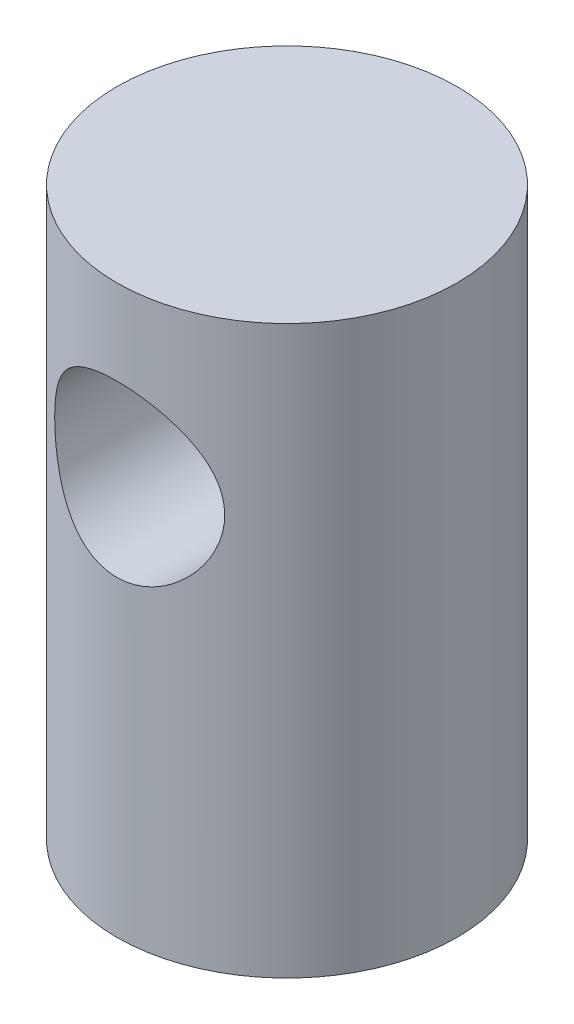
ISO-10303-21;
HEADER;
FILE_DESCRIPTION(('STEP AP214'),'2;1');
FILE_NAME('part.step','',(''),(''),'','','');
FILE_SCHEMA(('AUTOMOTIVE_DESIGN { 1 0 10303 214 1 1 1 1 }'));
ENDSEC;
DATA;
#1=APPLICATION_CONTEXT('core data for automotive mechanical design processes');
#2=APPLICATION_PROTOCOL_DEFINITION('international standard','automotive_design',2000,#1);
#3=PRODUCT_CONTEXT('',#1,'mechanical');
#4=PRODUCT('Part','Part','',(#3));
#5=PRODUCT_RELATED_PRODUCT_CATEGORY('part','',(#4));
#6=PRODUCT_DEFINITION_FORMATION('','',#4);
#7=PRODUCT_DEFINITION_CONTEXT('part definition',#1,'design');
#8=PRODUCT_DEFINITION('design','',#6,#7);
#9=PRODUCT_DEFINITION_SHAPE('','',#8);
#10=(LENGTH_UNIT() NAMED_UNIT(*) SI_UNIT(.MILLI.,.METRE.));
#11=(NAMED_UNIT(*) PLANE_ANGLE_UNIT() SI_UNIT($,.RADIAN.));
#12=(NAMED_UNIT(*) SI_UNIT($,.STERADIAN.) SOLID_ANGLE_UNIT());
#13=UNCERTAINTY_MEASURE_WITH_UNIT(LENGTH_MEASURE(1.E-05),#10,'distance_accuracy_value','');
#14=(GEOMETRIC_REPRESENTATION_CONTEXT(3) GLOBAL_UNCERTAINTY_ASSIGNED_CONTEXT((#13)) GLOBAL_UNIT_ASSIGNED_CONTEXT((#10,
#11,#12)) REPRESENTATION_CONTEXT('',''));
#15=CARTESIAN_POINT('',(0.,0.,0.));
#16=DIRECTION('',(0.,0.,1.));
#17=DIRECTION('',(1.,0.,0.));
#18=AXIS2_PLACEMENT_3D('',#15,#16,#17);
#19=CARTESIAN_POINT('',(0.,12.7,0.));
#20=DIRECTION('',(0.,-1.,0.));
#21=DIRECTION('',(0.,0.,-1.));
#22=AXIS2_PLACEMENT_3D('',#19,#20,#21);
#23=CYLINDRICAL_SURFACE('',#22,3.81);
#24=CARTESIAN_POINT('',(0.,12.7,0.));
#25=DIRECTION('',(0.,1.,0.));
#26=DIRECTION('',(0.,0.,1.));
#27=AXIS2_PLACEMENT_3D('',#24,#25,#26);
#28=CIRCLE('',#27,3.81);
#29=CARTESIAN_POINT('',(0.,12.7,3.81));
#30=VERTEX_POINT('',#29);
#31=EDGE_CURVE('E10',#30,#30,#28,.T.);
#32=ORIENTED_EDGE('',*,*,#31,.F.);
#33=EDGE_LOOP('',(#32));
#34=FACE_BOUND('',#33,.T.);
#35=CARTESIAN_POINT('',(0.,0.,0.));
#36=DIRECTION('',(0.,1.,0.));
#37=DIRECTION('',(0.,0.,1.));
#38=AXIS2_PLACEMENT_3D('',#35,#36,#37);
#39=CIRCLE('',#38,3.81);
#40=CARTESIAN_POINT('',(0.,0.,3.81));
#41=VERTEX_POINT('',#40);
#42=EDGE_CURVE('E47',#41,#41,#39,.T.);
#43=ORIENTED_EDGE('',*,*,#42,.T.);
#44=EDGE_LOOP('',(#43));
#45=FACE_BOUND('',#44,.T.);
#46=CARTESIAN_POINT('',(-1.905,8.89,3.29955678841871));
#47=CARTESIAN_POINT('',(-1.90499198708214,8.79073692178569,3.29956654394383));
#48=CARTESIAN_POINT('',(-1.89718915338941,8.69134452685156,3.30410470951591));
#49=CARTESIAN_POINT('',(-1.866373006325,8.49561244368785,3.32160278339791));
#50=CARTESIAN_POINT('',(-1.84332773093618,8.39927961690651,3.33458038748244));
#51=CARTESIAN_POINT('',(-1.78327032472124,8.21286474348429,3.36707513169226));
#52=CARTESIAN_POINT('',(-1.74633243851905,8.12275243094609,3.38655744838383));
#53=CARTESIAN_POINT('',(-1.65976465650994,7.95002685092146,3.42981274244804));
#54=CARTESIAN_POINT('',(-1.61013407408157,7.86741398945147,3.45358595191944));
#55=CARTESIAN_POINT('',(-1.49478975349745,7.70450760041545,3.50514036225373));
#56=CARTESIAN_POINT('',(-1.4280871271849,7.62496735011884,3.53309041410511));
#57=CARTESIAN_POINT('',(-1.28254850517537,7.4776170165065,3.58848627026471));
#58=CARTESIAN_POINT('',(-1.20370649407611,7.40981278429071,3.61593181698771));
#59=CARTESIAN_POINT('',(-1.0296326178128,7.28338557811796,3.66943913648482));
#60=CARTESIAN_POINT('',(-0.933654194937513,7.2256895725093,3.69528292740811));
#61=CARTESIAN_POINT('',(-0.731819135803414,7.1276066742853,3.74048190355419));
#62=CARTESIAN_POINT('',(-0.625968785187166,7.08720885798586,3.75984118201359));
#63=CARTESIAN_POINT('',(-0.415375618147424,7.02785362028905,3.7886727867368));
#64=CARTESIAN_POINT('',(-0.311089910872768,7.00757515231077,3.79875059821709));
#65=CARTESIAN_POINT('',(-0.100147047677825,6.984683543906,3.81014447225848));
#66=CARTESIAN_POINT('',(0.00650863413015958,6.98205971479954,3.8114658362441));
#67=CARTESIAN_POINT('',(0.209230959029217,6.99404241391774,3.80548480551051));
#68=CARTESIAN_POINT('',(0.305411884432316,7.00717041956906,3.79892234674623));
#69=CARTESIAN_POINT('',(0.493992735503874,7.04763800763724,3.77902937219762));
#70=CARTESIAN_POINT('',(0.586392377683784,7.0749786534994,3.76569834996465));
#71=CARTESIAN_POINT('',(0.766399390940143,7.1432722884014,3.73325866162997));
#72=CARTESIAN_POINT('',(0.853922771796453,7.18440837659287,3.71407261113128));
#73=CARTESIAN_POINT('',(1.02103580688285,7.27887180786376,3.67165215604635));
#74=CARTESIAN_POINT('',(1.10062260603761,7.33220351559095,3.64841630280006));
#75=CARTESIAN_POINT('',(1.25763082401107,7.45533564467042,3.59748571330533));
#76=CARTESIAN_POINT('',(1.33413641293093,7.52621626896105,3.56957711276524));
#77=CARTESIAN_POINT('',(1.47466882541727,7.67954342599198,3.51385518817876));
#78=CARTESIAN_POINT('',(1.53868604804891,7.76199877418208,3.48604195346023));
#79=CARTESIAN_POINT('',(1.65640766249341,7.94254480656788,3.43174617356183));
#80=CARTESIAN_POINT('',(1.70919898503319,8.04129587391827,3.40546029582298));
#81=CARTESIAN_POINT('',(1.79702291026734,8.24789626393889,3.35995232780687));
#82=CARTESIAN_POINT('',(1.83207404389174,8.35573595489845,3.34072287237758));
#83=CARTESIAN_POINT('',(1.8805783020027,8.56846364399371,3.3136453123145));
#84=CARTESIAN_POINT('',(1.89552285763855,8.67290833177796,3.30501604391386));
#85=CARTESIAN_POINT('',(1.90788978329477,8.88314455558901,3.29789636383866));
#86=CARTESIAN_POINT('',(1.90532453068513,8.98893508747321,3.29939879024139));
#87=CARTESIAN_POINT('',(1.88411366257025,9.18652071489246,3.31154411109814));
#88=CARTESIAN_POINT('',(1.86725779083724,9.27858085436053,3.32116914200176));
#89=CARTESIAN_POINT('',(1.82060142222481,9.45839063284624,3.34697111055305));
#90=CARTESIAN_POINT('',(1.79079673327802,9.54613886567254,3.3631501698959));
#91=CARTESIAN_POINT('',(1.71763865629227,9.71945858536937,3.40111503061746));
#92=CARTESIAN_POINT('',(1.6737216913345,9.80474102710501,3.42312580378035));
#93=CARTESIAN_POINT('',(1.57407685695025,9.96721896228279,3.47007407642261));
#94=CARTESIAN_POINT('',(1.5183429202534,10.0444102708966,3.49501307641559));
#95=CARTESIAN_POINT('',(1.38843480351322,10.1986945521281,3.54878637059317));
#96=CARTESIAN_POINT('',(1.31282174375767,10.2745485721004,3.57771540908909));
#97=CARTESIAN_POINT('',(1.14948556373608,10.4128803133945,3.63348717632896));
#98=CARTESIAN_POINT('',(1.06175836922721,10.4753535163518,3.66032919839729));
#99=CARTESIAN_POINT('',(0.873509865665426,10.5865429478707,3.70982294021229));
#100=CARTESIAN_POINT('',(0.772712000844651,10.6348525899488,3.73234537385049));
#101=CARTESIAN_POINT('',(0.562970104675267,10.7133477070911,3.76967791197634));
#102=CARTESIAN_POINT('',(0.454033321279064,10.7435490967591,3.78449478704111));
#103=CARTESIAN_POINT('',(0.241896294724125,10.7823671139296,3.80366603085923));
#104=CARTESIAN_POINT('',(0.139086800123056,10.7927099506027,3.80885562663092));
#105=CARTESIAN_POINT('',(-0.0669150028251223,10.7966064236309,3.81080258366636));
#106=CARTESIAN_POINT('',(-0.170107164529987,10.7901659372737,3.80756289674906));
#107=CARTESIAN_POINT('',(-0.366784876795357,10.7618217348386,3.79350210629254));
#108=CARTESIAN_POINT('',(-0.460461970607189,10.7409649252131,3.78319464317244));
#109=CARTESIAN_POINT('',(-0.642834533732313,10.6857921032841,3.75650938454101));
#110=CARTESIAN_POINT('',(-0.731529286560456,10.6514741608392,3.74013071852114));
#111=CARTESIAN_POINT('',(-0.905681609000894,10.5688248221207,3.70190897977004));
#112=CARTESIAN_POINT('',(-0.99083847335106,10.5199568431864,3.67986215390147));
#113=CARTESIAN_POINT('',(-1.15209561611304,10.4102706880675,3.63260894008916));
#114=CARTESIAN_POINT('',(-1.22819170900713,10.3494470232183,3.60740110290715));
#115=CARTESIAN_POINT('',(-1.37715149251169,10.2105492046297,3.55337000945654));
#116=CARTESIAN_POINT('',(-1.44893981749937,10.1313606927877,3.52443661119087));
#117=CARTESIAN_POINT('',(-1.5786023329529,9.96166515253845,3.46830166093714));
#118=CARTESIAN_POINT('',(-1.63646421361484,9.87114821737911,3.44110165662072));
#119=CARTESIAN_POINT('',(-1.73818595767762,9.67742327834094,3.39089224909556));
#120=CARTESIAN_POINT('',(-1.78154554518773,9.57390461002466,3.3680424409578));
#121=CARTESIAN_POINT('',(-1.83257122853322,9.41332434105153,3.34038147771082));
#122=CARTESIAN_POINT('',(-1.84723722005939,9.35896545088738,3.33226780836254));
#123=CARTESIAN_POINT('',(-1.87173936489303,9.24887098898107,3.31856771505668));
#124=CARTESIAN_POINT('',(-1.88157889504476,9.19313640850158,3.31297952435838));
#125=CARTESIAN_POINT('',(-1.89426468645562,9.09612024824196,3.30573720044492));
#126=CARTESIAN_POINT('',(-1.89828575114556,9.05503676296931,3.30342611219554));
#127=CARTESIAN_POINT('',(-1.90365516558915,8.97264300232902,3.30033382393031));
#128=CARTESIAN_POINT('',(-1.90500333654398,8.93133271197497,3.29955272626069));
#129=CARTESIAN_POINT('',(-1.905,8.89,3.29955678841871));
#130=B_SPLINE_CURVE_WITH_KNOTS('',3,(#46,#47,#48,#49,#50,#51,#52,#53,#54,#55,#56,#57,#58,#59,
#60,#61,#62,#63,#64,#65,#66,#67,#68,#69,#70,#71,#72,#73,#74,#75,#76,#77,#78,#79,#80,#81,#82,#83,
#84,#85,#86,#87,#88,#89,#90,#91,#92,#93,#94,#95,#96,#97,#98,#99,#100,#101,#102,#103,#104,#105,
#106,#107,#108,#109,#110,#111,#112,#113,#114,#115,#116,#117,#118,#119,#120,#121,#122,#123,#124,
#125,#126,#127,#128,#129),.UNSPECIFIED.,.T.,.F.,(4,2,2,2,2,2,2,2,2,2,2,2,2,2,2,2,2,2,2,2,2,2,2,
2,2,2,2,2,2,2,2,2,2,2,2,2,2,2,2,2,2,4),(0.,0.297622193542932,0.595870460831253,
0.892546975248113,1.18923954201175,1.51040270534787,1.831725529196,2.17470784718718,
2.51747325370086,2.8358493886779,3.1540327512578,3.44454665711919,3.73508230349625,
4.02963763666708,4.32429855266141,4.6468129972925,4.96957441912348,5.31283243498472,
5.65573114877171,5.97145664081147,6.28695897527724,6.56794819426642,6.84902844894574,
7.1431269965747,7.43737691253064,7.76871846524942,8.10017172787349,8.44037265595573,
8.78027415539583,9.08898875095846,9.39759525346389,9.68586629384066,9.97417868344258,
10.2748223012447,10.5756042634574,10.9063201072825,11.2373272112389,11.5787947692241,
11.7492204045702,11.9195266305643,12.0434469221419,12.1673755028827),.UNSPECIFIED.);
#131=CARTESIAN_POINT('',(-1.905,8.89,3.29955678841871));
#132=VERTEX_POINT('',#131);
#133=EDGE_CURVE('E39',#132,#132,#130,.T.);
#134=ORIENTED_EDGE('',*,*,#133,.F.);
#135=EDGE_LOOP('',(#134));
#136=FACE_BOUND('',#135,.T.);
#137=CARTESIAN_POINT('',(1.905,8.89,-3.29955678841871));
#138=CARTESIAN_POINT('',(1.90499198708214,8.79073692178569,-3.29956654394383));
#139=CARTESIAN_POINT('',(1.89718915338941,8.69134452685156,-3.30410470951591));
#140=CARTESIAN_POINT('',(1.866373006325,8.49561244368785,-3.32160278339791));
#141=CARTESIAN_POINT('',(1.84332773093618,8.39927961690651,-3.33458038748244));
#142=CARTESIAN_POINT('',(1.78327032472124,8.21286474348429,-3.36707513169226));
#143=CARTESIAN_POINT('',(1.74633243851905,8.12275243094609,-3.38655744838383));
#144=CARTESIAN_POINT('',(1.65976465650994,7.95002685092146,-3.42981274244804));
#145=CARTESIAN_POINT('',(1.61013407408157,7.86741398945147,-3.45358595191944));
#146=CARTESIAN_POINT('',(1.49478975349745,7.70450760041545,-3.50514036225373));
#147=CARTESIAN_POINT('',(1.4280871271849,7.62496735011884,-3.53309041410511));
#148=CARTESIAN_POINT('',(1.28254850517537,7.4776170165065,-3.58848627026471));
#149=CARTESIAN_POINT('',(1.20370649407611,7.40981278429072,-3.61593181698771));
#150=CARTESIAN_POINT('',(1.0296326178128,7.28338557811796,-3.66943913648482));
#151=CARTESIAN_POINT('',(0.933654194937514,7.2256895725093,-3.69528292740811));
#152=CARTESIAN_POINT('',(0.731819135803414,7.1276066742853,-3.74048190355419));
#153=CARTESIAN_POINT('',(0.625968785187166,7.08720885798586,-3.75984118201359));
#154=CARTESIAN_POINT('',(0.415375618147424,7.02785362028905,-3.7886727867368));
#155=CARTESIAN_POINT('',(0.311089910872768,7.00757515231077,-3.79875059821709));
#156=CARTESIAN_POINT('',(0.100147047677825,6.984683543906,-3.81014447225848));
#157=CARTESIAN_POINT('',(-0.00650863413015957,6.98205971479954,-3.8114658362441));
#158=CARTESIAN_POINT('',(-0.209230959029217,6.99404241391775,-3.80548480551051));
#159=CARTESIAN_POINT('',(-0.305411884432316,7.00717041956906,-3.79892234674623));
#160=CARTESIAN_POINT('',(-0.493992735503874,7.04763800763724,-3.77902937219762));
#161=CARTESIAN_POINT('',(-0.586392377683785,7.0749786534994,-3.76569834996465));
#162=CARTESIAN_POINT('',(-0.766399390940144,7.1432722884014,-3.73325866162997));
#163=CARTESIAN_POINT('',(-0.853922771796453,7.18440837659287,-3.71407261113128));
#164=CARTESIAN_POINT('',(-1.02103580688285,7.27887180786376,-3.67165215604635));
#165=CARTESIAN_POINT('',(-1.10062260603761,7.33220351559095,-3.64841630280006));
#166=CARTESIAN_POINT('',(-1.25763082401107,7.45533564467042,-3.59748571330533));
#167=CARTESIAN_POINT('',(-1.33413641293093,7.52621626896105,-3.56957711276524));
#168=CARTESIAN_POINT('',(-1.47466882541727,7.67954342599198,-3.51385518817876));
#169=CARTESIAN_POINT('',(-1.53868604804891,7.76199877418209,-3.48604195346023));
#170=CARTESIAN_POINT('',(-1.65640766249341,7.94254480656789,-3.43174617356183));
#171=CARTESIAN_POINT('',(-1.70919898503319,8.04129587391827,-3.40546029582298));
#172=CARTESIAN_POINT('',(-1.79702291026734,8.24789626393889,-3.35995232780687));
#173=CARTESIAN_POINT('',(-1.83207404389174,8.35573595489845,-3.34072287237758));
#174=CARTESIAN_POINT('',(-1.8805783020027,8.56846364399371,-3.3136453123145));
#175=CARTESIAN_POINT('',(-1.89552285763855,8.67290833177796,-3.30501604391386));
#176=CARTESIAN_POINT('',(-1.90788978329477,8.88314455558902,-3.29789636383866));
#177=CARTESIAN_POINT('',(-1.90532453068513,8.98893508747321,-3.29939879024139));
#178=CARTESIAN_POINT('',(-1.88411366257025,9.18652071489246,-3.31154411109814));
#179=CARTESIAN_POINT('',(-1.86725779083724,9.27858085436053,-3.32116914200176));
#180=CARTESIAN_POINT('',(-1.82060142222481,9.45839063284624,-3.34697111055305));
#181=CARTESIAN_POINT('',(-1.79079673327802,9.54613886567254,-3.3631501698959));
#182=CARTESIAN_POINT('',(-1.71763865629227,9.71945858536937,-3.40111503061746));
#183=CARTESIAN_POINT('',(-1.6737216913345,9.80474102710501,-3.42312580378035));
#184=CARTESIAN_POINT('',(-1.57407685695025,9.96721896228279,-3.47007407642261));
#185=CARTESIAN_POINT('',(-1.5183429202534,10.0444102708966,-3.49501307641559));
#186=CARTESIAN_POINT('',(-1.38843480351322,10.1986945521281,-3.54878637059317));
#187=CARTESIAN_POINT('',(-1.31282174375767,10.2745485721004,-3.57771540908909));
#188=CARTESIAN_POINT('',(-1.14948556373608,10.4128803133945,-3.63348717632896));
#189=CARTESIAN_POINT('',(-1.06175836922721,10.4753535163518,-3.66032919839729));
#190=CARTESIAN_POINT('',(-0.873509865665426,10.5865429478707,-3.70982294021229));
#191=CARTESIAN_POINT('',(-0.772712000844651,10.6348525899488,-3.73234537385049));
#192=CARTESIAN_POINT('',(-0.562970104675267,10.7133477070911,-3.76967791197634));
#193=CARTESIAN_POINT('',(-0.454033321279064,10.7435490967591,-3.78449478704111));
#194=CARTESIAN_POINT('',(-0.241896294724125,10.7823671139296,-3.80366603085923));
#195=CARTESIAN_POINT('',(-0.139086800123056,10.7927099506027,-3.80885562663092));
#196=CARTESIAN_POINT('',(0.0669150028251231,10.7966064236309,-3.81080258366636));
#197=CARTESIAN_POINT('',(0.170107164529987,10.7901659372737,-3.80756289674906));
#198=CARTESIAN_POINT('',(0.366784876795358,10.7618217348386,-3.79350210629254));
#199=CARTESIAN_POINT('',(0.460461970607191,10.7409649252131,-3.78319464317244));
#200=CARTESIAN_POINT('',(0.642834533732315,10.6857921032841,-3.75650938454101));
#201=CARTESIAN_POINT('',(0.731529286560458,10.6514741608392,-3.74013071852114));
#202=CARTESIAN_POINT('',(0.905681609000896,10.5688248221207,-3.70190897977004));
#203=CARTESIAN_POINT('',(0.990838473351061,10.5199568431864,-3.67986215390147));
#204=CARTESIAN_POINT('',(1.15209561611304,10.4102706880675,-3.63260894008916));
#205=CARTESIAN_POINT('',(1.22819170900713,10.3494470232183,-3.60740110290715));
#206=CARTESIAN_POINT('',(1.37715149251169,10.2105492046297,-3.55337000945654));
#207=CARTESIAN_POINT('',(1.44893981749937,10.1313606927877,-3.52443661119087));
#208=CARTESIAN_POINT('',(1.57860233295291,9.96166515253845,-3.46830166093714));
#209=CARTESIAN_POINT('',(1.63646421361485,9.87114821737911,-3.44110165662072));
#210=CARTESIAN_POINT('',(1.73818595767762,9.67742327834094,-3.39089224909555));
#211=CARTESIAN_POINT('',(1.78154554518773,9.57390461002466,-3.3680424409578));
#212=CARTESIAN_POINT('',(1.83257122853322,9.41332434105153,-3.34038147771082));
#213=CARTESIAN_POINT('',(1.84723722005939,9.35896545088738,-3.33226780836254));
#214=CARTESIAN_POINT('',(1.87173936489303,9.24887098898107,-3.31856771505667));
#215=CARTESIAN_POINT('',(1.88157889504476,9.19313640850157,-3.31297952435838));
#216=CARTESIAN_POINT('',(1.89426468645562,9.09612024824196,-3.30573720044492));
#217=CARTESIAN_POINT('',(1.89828575114556,9.0550367629693,-3.30342611219554));
#218=CARTESIAN_POINT('',(1.90365516558915,8.97264300232902,-3.30033382393031));
#219=CARTESIAN_POINT('',(1.90500333654398,8.93133271197497,-3.29955272626068));
#220=CARTESIAN_POINT('',(1.905,8.89,-3.29955678841871));
#221=B_SPLINE_CURVE_WITH_KNOTS('',3,(#137,#138,#139,#140,#141,#142,#143,#144,#145,#146,#147,
#148,#149,#150,#151,#152,#153,#154,#155,#156,#157,#158,#159,#160,#161,#162,#163,#164,#165,#166,
#167,#168,#169,#170,#171,#172,#173,#174,#175,#176,#177,#178,#179,#180,#181,#182,#183,#184,#185,
#186,#187,#188,#189,#190,#191,#192,#193,#194,#195,#196,#197,#198,#199,#200,#201,#202,#203,#204,
#205,#206,#207,#208,#209,#210,#211,#212,#213,#214,#215,#216,#217,#218,#219,#220),.UNSPECIFIED.,
.T.,.F.,(4,2,2,2,2,2,2,2,2,2,2,2,2,2,2,2,2,2,2,2,2,2,2,2,2,2,2,2,2,2,2,2,2,2,2,2,2,2,2,2,2,4),
(0.,0.297622193542933,0.595870460831253,0.892546975248113,1.18923954201174,1.51040270534787,
1.831725529196,2.17470784718718,2.51747325370086,2.8358493886779,3.1540327512578,
3.44454665711919,3.73508230349625,4.02963763666708,4.32429855266141,4.6468129972925,
4.96957441912348,5.31283243498472,5.65573114877171,5.97145664081147,6.28695897527724,
6.56794819426642,6.84902844894574,7.14312699657471,7.43737691253064,7.76871846524942,
8.10017172787349,8.44037265595573,8.78027415539584,9.08898875095846,9.3975952534639,
9.68586629384067,9.97417868344258,10.2748223012447,10.5756042634574,10.9063201072825,
11.2373272112389,11.5787947692242,11.7492204045702,11.9195266305643,12.0434469221419,
12.1673755028828),.UNSPECIFIED.);
#222=CARTESIAN_POINT('',(1.905,8.89,-3.29955678841871));
#223=VERTEX_POINT('',#222);
#224=EDGE_CURVE('E53',#223,#223,#221,.T.);
#225=ORIENTED_EDGE('',*,*,#224,.F.);
#226=EDGE_LOOP('',(#225));
#227=FACE_BOUND('',#226,.T.);
#228=ADVANCED_FACE('F35',(#34,#45,#136,#227),#23,.T.);
#229=CARTESIAN_POINT('',(0.,12.7,0.));
#230=DIRECTION('',(0.,1.,0.));
#231=DIRECTION('',(0.,0.,1.));
#232=AXIS2_PLACEMENT_3D('',#229,#230,#231);
#233=PLANE('',#232);
#234=ORIENTED_EDGE('',*,*,#31,.T.);
#235=EDGE_LOOP('',(#234));
#236=FACE_BOUND('',#235,.T.);
#237=ADVANCED_FACE('F68',(#236),#233,.T.);
#238=CARTESIAN_POINT('',(0.,0.,0.));
#239=DIRECTION('',(0.,1.,0.));
#240=DIRECTION('',(0.,0.,1.));
#241=AXIS2_PLACEMENT_3D('',#238,#239,#240);
#242=PLANE('',#241);
#243=ORIENTED_EDGE('',*,*,#42,.F.);
#244=EDGE_LOOP('',(#243));
#245=FACE_BOUND('',#244,.T.);
#246=ADVANCED_FACE('F66',(#245),#242,.F.);
#247=CARTESIAN_POINT('',(0.,8.89,19.05));
#248=DIRECTION('',(0.,0.,-1.));
#249=DIRECTION('',(-1.,0.,0.));
#250=AXIS2_PLACEMENT_3D('',#247,#248,#249);
#251=CYLINDRICAL_SURFACE('',#250,1.905);
#252=ORIENTED_EDGE('',*,*,#224,.T.);
#253=EDGE_LOOP('',(#252));
#254=FACE_BOUND('',#253,.T.);
#255=ORIENTED_EDGE('',*,*,#133,.T.);
#256=EDGE_LOOP('',(#255));
#257=FACE_BOUND('',#256,.T.);
#258=ADVANCED_FACE('F62',(#254,#257),#251,.F.);
#259=CLOSED_SHELL('',(#228,#237,#246,#258));
#260=MANIFOLD_SOLID_BREP('B2',#259);
#261=ADVANCED_BREP_SHAPE_REPRESENTATION('',(#18,#260),#14);
#262=SHAPE_DEFINITION_REPRESENTATION(#9,#261);
ENDSEC;
END-ISO-10303-21;
